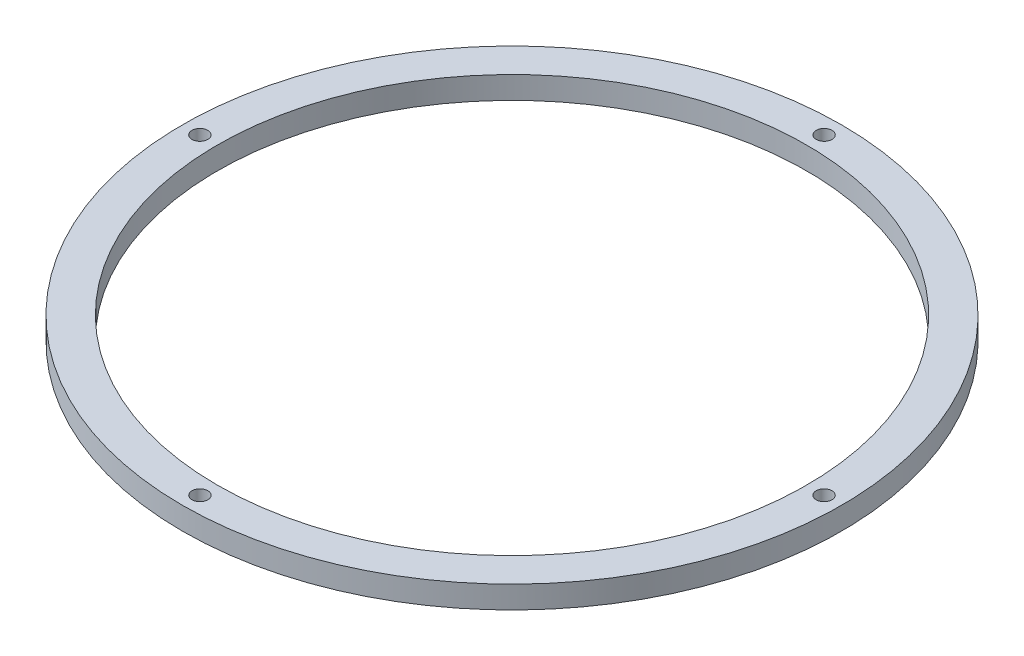
ISO-10303-21;
HEADER;
FILE_DESCRIPTION(('STEP AP214'),'2;1');
FILE_NAME('part.step','',(''),(''),'','','');
FILE_SCHEMA(('AUTOMOTIVE_DESIGN { 1 0 10303 214 1 1 1 1 }'));
ENDSEC;
DATA;
#1=APPLICATION_CONTEXT('core data for automotive mechanical design processes');
#2=APPLICATION_PROTOCOL_DEFINITION('international standard','automotive_design',2000,#1);
#3=PRODUCT_CONTEXT('',#1,'mechanical');
#4=PRODUCT('Part','Part','',(#3));
#5=PRODUCT_RELATED_PRODUCT_CATEGORY('part','',(#4));
#6=PRODUCT_DEFINITION_FORMATION('','',#4);
#7=PRODUCT_DEFINITION_CONTEXT('part definition',#1,'design');
#8=PRODUCT_DEFINITION('design','',#6,#7);
#9=PRODUCT_DEFINITION_SHAPE('','',#8);
#10=(LENGTH_UNIT() NAMED_UNIT(*) SI_UNIT(.MILLI.,.METRE.));
#11=(NAMED_UNIT(*) PLANE_ANGLE_UNIT() SI_UNIT($,.RADIAN.));
#12=(NAMED_UNIT(*) SI_UNIT($,.STERADIAN.) SOLID_ANGLE_UNIT());
#13=UNCERTAINTY_MEASURE_WITH_UNIT(LENGTH_MEASURE(1.E-05),#10,'distance_accuracy_value','');
#14=(GEOMETRIC_REPRESENTATION_CONTEXT(3) GLOBAL_UNCERTAINTY_ASSIGNED_CONTEXT((#13)) GLOBAL_UNIT_ASSIGNED_CONTEXT((#10,
#11,#12)) REPRESENTATION_CONTEXT('',''));
#15=CARTESIAN_POINT('',(0.,0.,0.));
#16=DIRECTION('',(0.,0.,1.));
#17=DIRECTION('',(1.,0.,0.));
#18=AXIS2_PLACEMENT_3D('',#15,#16,#17);
#19=CARTESIAN_POINT('',(0.,8.5,0.));
#20=DIRECTION('',(0.,1.,0.));
#21=DIRECTION('',(0.,0.,1.));
#22=AXIS2_PLACEMENT_3D('',#19,#20,#21);
#23=PLANE('',#22);
#24=CARTESIAN_POINT('',(0.,8.5,118.375));
#25=DIRECTION('',(0.,1.,0.));
#26=DIRECTION('',(0.,0.,1.));
#27=AXIS2_PLACEMENT_3D('',#24,#25,#26);
#28=CIRCLE('',#27,3.);
#29=CARTESIAN_POINT('',(0.,8.5,121.375));
#30=VERTEX_POINT('',#29);
#31=EDGE_CURVE('E71',#30,#30,#28,.T.);
#32=ORIENTED_EDGE('',*,*,#31,.F.);
#33=EDGE_LOOP('',(#32));
#34=FACE_BOUND('',#33,.T.);
#35=CARTESIAN_POINT('',(-118.375,8.5,0.));
#36=DIRECTION('',(0.,1.,0.));
#37=DIRECTION('',(0.,0.,1.));
#38=AXIS2_PLACEMENT_3D('',#35,#36,#37);
#39=CIRCLE('',#38,3.00000000000001);
#40=CARTESIAN_POINT('',(-118.375,8.5,3.00000000000001));
#41=VERTEX_POINT('',#40);
#42=EDGE_CURVE('E66',#41,#41,#39,.T.);
#43=ORIENTED_EDGE('',*,*,#42,.F.);
#44=EDGE_LOOP('',(#43));
#45=FACE_BOUND('',#44,.T.);
#46=CARTESIAN_POINT('',(118.375,8.5,0.));
#47=DIRECTION('',(0.,1.,0.));
#48=DIRECTION('',(0.,0.,1.));
#49=AXIS2_PLACEMENT_3D('',#46,#47,#48);
#50=CIRCLE('',#49,3.00000000000001);
#51=CARTESIAN_POINT('',(118.375,8.5,3.00000000000001));
#52=VERTEX_POINT('',#51);
#53=EDGE_CURVE('E61',#52,#52,#50,.T.);
#54=ORIENTED_EDGE('',*,*,#53,.F.);
#55=EDGE_LOOP('',(#54));
#56=FACE_BOUND('',#55,.T.);
#57=CARTESIAN_POINT('',(0.,8.5,-118.375));
#58=DIRECTION('',(0.,1.,0.));
#59=DIRECTION('',(0.,0.,1.));
#60=AXIS2_PLACEMENT_3D('',#57,#58,#59);
#61=CIRCLE('',#60,3.);
#62=CARTESIAN_POINT('',(0.,8.5,-115.375));
#63=VERTEX_POINT('',#62);
#64=EDGE_CURVE('E59',#63,#63,#61,.T.);
#65=ORIENTED_EDGE('',*,*,#64,.F.);
#66=EDGE_LOOP('',(#65));
#67=FACE_BOUND('',#66,.T.);
#68=CARTESIAN_POINT('',(0.,8.5,0.));
#69=DIRECTION('',(0.,1.,0.));
#70=DIRECTION('',(0.,0.,1.));
#71=AXIS2_PLACEMENT_3D('',#68,#69,#70);
#72=CIRCLE('',#71,125.);
#73=CARTESIAN_POINT('',(0.,8.5,125.));
#74=VERTEX_POINT('',#73);
#75=EDGE_CURVE('E10',#74,#74,#72,.T.);
#76=ORIENTED_EDGE('',*,*,#75,.T.);
#77=EDGE_LOOP('',(#76));
#78=FACE_BOUND('',#77,.T.);
#79=CARTESIAN_POINT('',(0.,8.5,0.));
#80=DIRECTION('',(0.,1.,0.));
#81=DIRECTION('',(0.,0.,1.));
#82=AXIS2_PLACEMENT_3D('',#79,#80,#81);
#83=CIRCLE('',#82,111.75);
#84=CARTESIAN_POINT('',(0.,8.5,111.75));
#85=VERTEX_POINT('',#84);
#86=EDGE_CURVE('E50',#85,#85,#83,.T.);
#87=ORIENTED_EDGE('',*,*,#86,.F.);
#88=EDGE_LOOP('',(#87));
#89=FACE_BOUND('',#88,.T.);
#90=ADVANCED_FACE('F38',(#34,#45,#56,#67,#78,#89),#23,.T.);
#91=CARTESIAN_POINT('',(0.,0.,0.));
#92=DIRECTION('',(0.,1.,0.));
#93=DIRECTION('',(0.,0.,1.));
#94=AXIS2_PLACEMENT_3D('',#91,#92,#93);
#95=PLANE('',#94);
#96=CARTESIAN_POINT('',(0.,0.,118.375));
#97=DIRECTION('',(0.,1.,0.));
#98=DIRECTION('',(0.,0.,1.));
#99=AXIS2_PLACEMENT_3D('',#96,#97,#98);
#100=CIRCLE('',#99,3.);
#101=CARTESIAN_POINT('',(0.,0.,121.375));
#102=VERTEX_POINT('',#101);
#103=EDGE_CURVE('E55',#102,#102,#100,.T.);
#104=ORIENTED_EDGE('',*,*,#103,.T.);
#105=EDGE_LOOP('',(#104));
#106=FACE_BOUND('',#105,.T.);
#107=CARTESIAN_POINT('',(-118.375,0.,0.));
#108=DIRECTION('',(0.,1.,0.));
#109=DIRECTION('',(0.,0.,1.));
#110=AXIS2_PLACEMENT_3D('',#107,#108,#109);
#111=CIRCLE('',#110,3.00000000000001);
#112=CARTESIAN_POINT('',(-118.375,0.,3.00000000000001));
#113=VERTEX_POINT('',#112);
#114=EDGE_CURVE('E70',#113,#113,#111,.T.);
#115=ORIENTED_EDGE('',*,*,#114,.T.);
#116=EDGE_LOOP('',(#115));
#117=FACE_BOUND('',#116,.T.);
#118=CARTESIAN_POINT('',(118.375,0.,0.));
#119=DIRECTION('',(0.,1.,0.));
#120=DIRECTION('',(0.,0.,1.));
#121=AXIS2_PLACEMENT_3D('',#118,#119,#120);
#122=CIRCLE('',#121,3.00000000000001);
#123=CARTESIAN_POINT('',(118.375,0.,3.00000000000001));
#124=VERTEX_POINT('',#123);
#125=EDGE_CURVE('E62',#124,#124,#122,.T.);
#126=ORIENTED_EDGE('',*,*,#125,.T.);
#127=EDGE_LOOP('',(#126));
#128=FACE_BOUND('',#127,.T.);
#129=CARTESIAN_POINT('',(0.,0.,-118.375));
#130=DIRECTION('',(0.,1.,0.));
#131=DIRECTION('',(0.,0.,1.));
#132=AXIS2_PLACEMENT_3D('',#129,#130,#131);
#133=CIRCLE('',#132,3.);
#134=CARTESIAN_POINT('',(0.,0.,-115.375));
#135=VERTEX_POINT('',#134);
#136=EDGE_CURVE('E54',#135,#135,#133,.T.);
#137=ORIENTED_EDGE('',*,*,#136,.T.);
#138=EDGE_LOOP('',(#137));
#139=FACE_BOUND('',#138,.T.);
#140=CARTESIAN_POINT('',(0.,0.,0.));
#141=DIRECTION('',(0.,1.,0.));
#142=DIRECTION('',(0.,0.,1.));
#143=AXIS2_PLACEMENT_3D('',#140,#141,#142);
#144=CIRCLE('',#143,125.);
#145=CARTESIAN_POINT('',(0.,0.,125.));
#146=VERTEX_POINT('',#145);
#147=EDGE_CURVE('E37',#146,#146,#144,.T.);
#148=ORIENTED_EDGE('',*,*,#147,.F.);
#149=EDGE_LOOP('',(#148));
#150=FACE_BOUND('',#149,.T.);
#151=CARTESIAN_POINT('',(0.,0.,0.));
#152=DIRECTION('',(0.,1.,0.));
#153=DIRECTION('',(0.,0.,1.));
#154=AXIS2_PLACEMENT_3D('',#151,#152,#153);
#155=CIRCLE('',#154,111.75);
#156=CARTESIAN_POINT('',(0.,0.,111.75));
#157=VERTEX_POINT('',#156);
#158=EDGE_CURVE('E47',#157,#157,#155,.T.);
#159=ORIENTED_EDGE('',*,*,#158,.T.);
#160=EDGE_LOOP('',(#159));
#161=FACE_BOUND('',#160,.T.);
#162=ADVANCED_FACE('F76',(#106,#117,#128,#139,#150,#161),#95,.F.);
#163=CARTESIAN_POINT('',(0.,8.5,0.));
#164=DIRECTION('',(0.,-1.,0.));
#165=DIRECTION('',(0.,0.,-1.));
#166=AXIS2_PLACEMENT_3D('',#163,#164,#165);
#167=CYLINDRICAL_SURFACE('',#166,125.);
#168=ORIENTED_EDGE('',*,*,#75,.F.);
#169=EDGE_LOOP('',(#168));
#170=FACE_BOUND('',#169,.T.);
#171=ORIENTED_EDGE('',*,*,#147,.T.);
#172=EDGE_LOOP('',(#171));
#173=FACE_BOUND('',#172,.T.);
#174=ADVANCED_FACE('F36',(#170,#173),#167,.T.);
#175=CARTESIAN_POINT('',(0.,8.5,0.));
#176=DIRECTION('',(0.,-1.,0.));
#177=DIRECTION('',(0.,0.,-1.));
#178=AXIS2_PLACEMENT_3D('',#175,#176,#177);
#179=CYLINDRICAL_SURFACE('',#178,111.75);
#180=ORIENTED_EDGE('',*,*,#86,.T.);
#181=EDGE_LOOP('',(#180));
#182=FACE_BOUND('',#181,.T.);
#183=ORIENTED_EDGE('',*,*,#158,.F.);
#184=EDGE_LOOP('',(#183));
#185=FACE_BOUND('',#184,.T.);
#186=ADVANCED_FACE('F99',(#182,#185),#179,.F.);
#187=CARTESIAN_POINT('',(0.,0.,-118.375));
#188=DIRECTION('',(0.,1.,0.));
#189=DIRECTION('',(0.,0.,1.));
#190=AXIS2_PLACEMENT_3D('',#187,#188,#189);
#191=CYLINDRICAL_SURFACE('',#190,3.);
#192=ORIENTED_EDGE('',*,*,#136,.F.);
#193=EDGE_LOOP('',(#192));
#194=FACE_BOUND('',#193,.T.);
#195=ORIENTED_EDGE('',*,*,#64,.T.);
#196=EDGE_LOOP('',(#195));
#197=FACE_BOUND('',#196,.T.);
#198=ADVANCED_FACE('F103',(#194,#197),#191,.F.);
#199=CARTESIAN_POINT('',(118.375,0.,0.));
#200=DIRECTION('',(0.,1.,0.));
#201=DIRECTION('',(0.,0.,1.));
#202=AXIS2_PLACEMENT_3D('',#199,#200,#201);
#203=CYLINDRICAL_SURFACE('',#202,3.00000000000001);
#204=ORIENTED_EDGE('',*,*,#125,.F.);
#205=EDGE_LOOP('',(#204));
#206=FACE_BOUND('',#205,.T.);
#207=ORIENTED_EDGE('',*,*,#53,.T.);
#208=EDGE_LOOP('',(#207));
#209=FACE_BOUND('',#208,.T.);
#210=ADVANCED_FACE('F113',(#206,#209),#203,.F.);
#211=CARTESIAN_POINT('',(-118.375,0.,0.));
#212=DIRECTION('',(0.,1.,0.));
#213=DIRECTION('',(0.,0.,1.));
#214=AXIS2_PLACEMENT_3D('',#211,#212,#213);
#215=CYLINDRICAL_SURFACE('',#214,3.00000000000001);
#216=ORIENTED_EDGE('',*,*,#114,.F.);
#217=EDGE_LOOP('',(#216));
#218=FACE_BOUND('',#217,.T.);
#219=ORIENTED_EDGE('',*,*,#42,.T.);
#220=EDGE_LOOP('',(#219));
#221=FACE_BOUND('',#220,.T.);
#222=ADVANCED_FACE('F81',(#218,#221),#215,.F.);
#223=CARTESIAN_POINT('',(0.,0.,118.375));
#224=DIRECTION('',(0.,1.,0.));
#225=DIRECTION('',(0.,0.,1.));
#226=AXIS2_PLACEMENT_3D('',#223,#224,#225);
#227=CYLINDRICAL_SURFACE('',#226,3.);
#228=ORIENTED_EDGE('',*,*,#103,.F.);
#229=EDGE_LOOP('',(#228));
#230=FACE_BOUND('',#229,.T.);
#231=ORIENTED_EDGE('',*,*,#31,.T.);
#232=EDGE_LOOP('',(#231));
#233=FACE_BOUND('',#232,.T.);
#234=ADVANCED_FACE('F85',(#230,#233),#227,.F.);
#235=CLOSED_SHELL('',(#90,#162,#174,#186,#198,#210,#222,#234));
#236=MANIFOLD_SOLID_BREP('B2',#235);
#237=ADVANCED_BREP_SHAPE_REPRESENTATION('',(#18,#236),#14);
#238=SHAPE_DEFINITION_REPRESENTATION(#9,#237);
ENDSEC;
END-ISO-10303-21;
